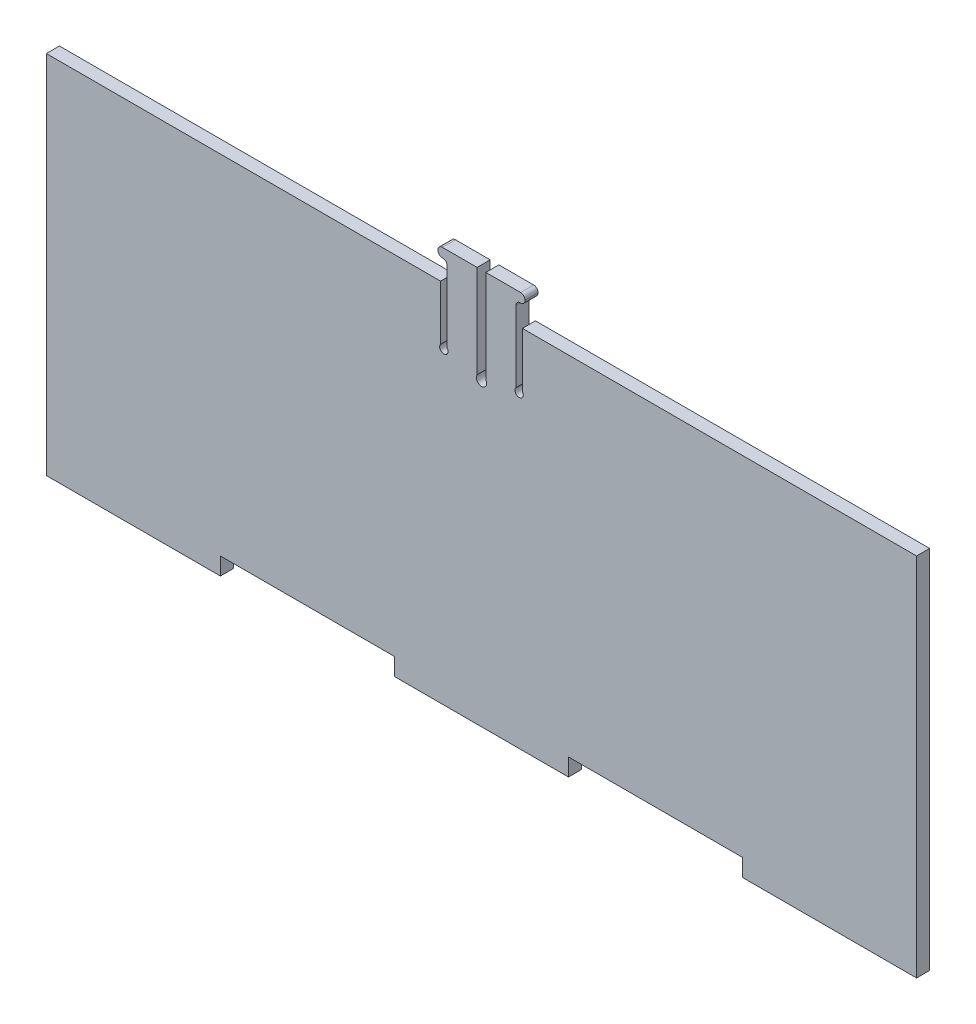
ISO-10303-21;
HEADER;
FILE_DESCRIPTION(('STEP AP214'),'2;1');
FILE_NAME('part.step','',(''),(''),'','','');
FILE_SCHEMA(('AUTOMOTIVE_DESIGN { 1 0 10303 214 1 1 1 1 }'));
ENDSEC;
DATA;
#1=APPLICATION_CONTEXT('core data for automotive mechanical design processes');
#2=APPLICATION_PROTOCOL_DEFINITION('international standard','automotive_design',2000,#1);
#3=PRODUCT_CONTEXT('',#1,'mechanical');
#4=PRODUCT('Part','Part','',(#3));
#5=PRODUCT_RELATED_PRODUCT_CATEGORY('part','',(#4));
#6=PRODUCT_DEFINITION_FORMATION('','',#4);
#7=PRODUCT_DEFINITION_CONTEXT('part definition',#1,'design');
#8=PRODUCT_DEFINITION('design','',#6,#7);
#9=PRODUCT_DEFINITION_SHAPE('','',#8);
#10=(LENGTH_UNIT() NAMED_UNIT(*) SI_UNIT(.MILLI.,.METRE.));
#11=(NAMED_UNIT(*) PLANE_ANGLE_UNIT() SI_UNIT($,.RADIAN.));
#12=(NAMED_UNIT(*) SI_UNIT($,.STERADIAN.) SOLID_ANGLE_UNIT());
#13=UNCERTAINTY_MEASURE_WITH_UNIT(LENGTH_MEASURE(1.E-05),#10,'distance_accuracy_value','');
#14=(GEOMETRIC_REPRESENTATION_CONTEXT(3) GLOBAL_UNCERTAINTY_ASSIGNED_CONTEXT((#13)) GLOBAL_UNIT_ASSIGNED_CONTEXT((#10,
#11,#12)) REPRESENTATION_CONTEXT('',''));
#15=CARTESIAN_POINT('',(0.,0.,0.));
#16=DIRECTION('',(0.,0.,1.));
#17=DIRECTION('',(1.,0.,0.));
#18=AXIS2_PLACEMENT_3D('',#15,#16,#17);
#19=CARTESIAN_POINT('',(0.,26.9392668132343,3.));
#20=DIRECTION('',(0.,0.,-1.));
#21=DIRECTION('',(-1.,0.,0.));
#22=AXIS2_PLACEMENT_3D('',#19,#20,#21);
#23=CYLINDRICAL_SURFACE('',#22,1.18948390251817);
#24=CARTESIAN_POINT('',(0.,26.9392668132343,0.));
#25=DIRECTION('',(0.,0.,1.));
#26=DIRECTION('',(1.,0.,0.));
#27=AXIS2_PLACEMENT_3D('',#24,#25,#26);
#28=CIRCLE('',#27,1.18948390251817);
#29=CARTESIAN_POINT('',(-1.00000000000001,27.5833723592047,0.));
#30=VERTEX_POINT('',#29);
#31=CARTESIAN_POINT('',(1.00000000000001,27.5833723592047,0.));
#32=VERTEX_POINT('',#31);
#33=EDGE_CURVE('E282',#30,#32,#28,.T.);
#34=ORIENTED_EDGE('',*,*,#33,.F.);
#35=DIRECTION('',(0.,0.,-1.));
#36=VECTOR('',#35,1.);
#37=CARTESIAN_POINT('',(-1.00000000000001,27.5833723592047,3.));
#38=LINE('',#37,#36);
#39=CARTESIAN_POINT('',(-1.00000000000001,27.5833723592047,3.));
#40=VERTEX_POINT('',#39);
#41=EDGE_CURVE('E11',#40,#30,#38,.T.);
#42=ORIENTED_EDGE('',*,*,#41,.F.);
#43=CARTESIAN_POINT('',(0.,26.9392668132343,3.));
#44=DIRECTION('',(0.,0.,1.));
#45=DIRECTION('',(1.,0.,0.));
#46=AXIS2_PLACEMENT_3D('',#43,#44,#45);
#47=CIRCLE('',#46,1.18948390251817);
#48=CARTESIAN_POINT('',(1.00000000000001,27.5833723592047,3.));
#49=VERTEX_POINT('',#48);
#50=EDGE_CURVE('E366',#40,#49,#47,.T.);
#51=ORIENTED_EDGE('',*,*,#50,.T.);
#52=DIRECTION('',(0.,0.,-1.));
#53=VECTOR('',#52,1.);
#54=CARTESIAN_POINT('',(1.00000000000001,27.5833723592047,3.));
#55=LINE('',#54,#53);
#56=EDGE_CURVE('E48',#49,#32,#55,.T.);
#57=ORIENTED_EDGE('',*,*,#56,.T.);
#58=EDGE_LOOP('',(#34,#42,#51,#57));
#59=FACE_BOUND('',#58,.T.);
#60=ADVANCED_FACE('F32',(#59),#23,.F.);
#61=CARTESIAN_POINT('',(-1.00000000000001,0.,3.));
#62=DIRECTION('',(-1.,0.,0.));
#63=DIRECTION('',(0.,0.,1.));
#64=AXIS2_PLACEMENT_3D('',#61,#62,#63);
#65=PLANE('',#64);
#66=DIRECTION('',(0.,1.,0.));
#67=VECTOR('',#66,1.);
#68=CARTESIAN_POINT('',(-1.00000000000001,0.,0.));
#69=LINE('',#68,#67);
#70=CARTESIAN_POINT('',(-1.00000000000001,48.9392668132343,0.));
#71=VERTEX_POINT('',#70);
#72=EDGE_CURVE('E284',#30,#71,#69,.T.);
#73=ORIENTED_EDGE('',*,*,#72,.T.);
#74=DIRECTION('',(0.,0.,-1.));
#75=VECTOR('',#74,1.);
#76=CARTESIAN_POINT('',(-1.00000000000001,48.9392668132343,3.));
#77=LINE('',#76,#75);
#78=CARTESIAN_POINT('',(-1.00000000000001,48.9392668132343,3.));
#79=VERTEX_POINT('',#78);
#80=EDGE_CURVE('E40',#79,#71,#77,.T.);
#81=ORIENTED_EDGE('',*,*,#80,.F.);
#82=DIRECTION('',(0.,1.,0.));
#83=VECTOR('',#82,1.);
#84=CARTESIAN_POINT('',(-1.00000000000001,0.,3.));
#85=LINE('',#84,#83);
#86=EDGE_CURVE('E939',#40,#79,#85,.T.);
#87=ORIENTED_EDGE('',*,*,#86,.F.);
#88=ORIENTED_EDGE('',*,*,#41,.T.);
#89=EDGE_LOOP('',(#73,#81,#87,#88));
#90=FACE_BOUND('',#89,.T.);
#91=ADVANCED_FACE('F543',(#90),#65,.F.);
#92=CARTESIAN_POINT('',(0.,48.9392668132343,3.));
#93=DIRECTION('',(0.,-1.,0.));
#94=DIRECTION('',(0.,0.,-1.));
#95=AXIS2_PLACEMENT_3D('',#92,#93,#94);
#96=PLANE('',#95);
#97=DIRECTION('',(-1.,0.,0.));
#98=VECTOR('',#97,1.);
#99=CARTESIAN_POINT('',(0.,48.9392668132343,0.));
#100=LINE('',#99,#98);
#101=CARTESIAN_POINT('',(-9.,48.9392668132343,0.));
#102=VERTEX_POINT('',#101);
#103=EDGE_CURVE('E286',#71,#102,#100,.T.);
#104=ORIENTED_EDGE('',*,*,#103,.T.);
#105=DIRECTION('',(0.,0.,-1.));
#106=VECTOR('',#105,1.);
#107=CARTESIAN_POINT('',(-9.,48.9392668132343,3.));
#108=LINE('',#107,#106);
#109=CARTESIAN_POINT('',(-9.,48.9392668132343,3.));
#110=VERTEX_POINT('',#109);
#111=EDGE_CURVE('E436',#110,#102,#108,.T.);
#112=ORIENTED_EDGE('',*,*,#111,.F.);
#113=DIRECTION('',(-1.,0.,0.));
#114=VECTOR('',#113,1.);
#115=CARTESIAN_POINT('',(0.,48.9392668132343,3.));
#116=LINE('',#115,#114);
#117=EDGE_CURVE('E445',#79,#110,#116,.T.);
#118=ORIENTED_EDGE('',*,*,#117,.F.);
#119=ORIENTED_EDGE('',*,*,#80,.T.);
#120=EDGE_LOOP('',(#104,#112,#118,#119));
#121=FACE_BOUND('',#120,.T.);
#122=ADVANCED_FACE('F443',(#121),#96,.F.);
#123=CARTESIAN_POINT('',(-9.00000000000001,47.9392668132343,3.));
#124=DIRECTION('',(0.,0.,-1.));
#125=DIRECTION('',(-1.,0.,0.));
#126=AXIS2_PLACEMENT_3D('',#123,#124,#125);
#127=CYLINDRICAL_SURFACE('',#126,1.);
#128=CARTESIAN_POINT('',(-9.00000000000001,47.9392668132343,0.));
#129=DIRECTION('',(0.,0.,1.));
#130=DIRECTION('',(1.,0.,0.));
#131=AXIS2_PLACEMENT_3D('',#128,#129,#130);
#132=CIRCLE('',#131,1.);
#133=CARTESIAN_POINT('',(-10.,47.9392668132343,0.));
#134=VERTEX_POINT('',#133);
#135=EDGE_CURVE('E288',#102,#134,#132,.T.);
#136=ORIENTED_EDGE('',*,*,#135,.T.);
#137=DIRECTION('',(0.,0.,-1.));
#138=VECTOR('',#137,1.);
#139=CARTESIAN_POINT('',(-10.,47.9392668132343,3.));
#140=LINE('',#139,#138);
#141=CARTESIAN_POINT('',(-10.,47.9392668132343,3.));
#142=VERTEX_POINT('',#141);
#143=EDGE_CURVE('E433',#142,#134,#140,.T.);
#144=ORIENTED_EDGE('',*,*,#143,.F.);
#145=CARTESIAN_POINT('',(-9.00000000000001,47.9392668132343,3.));
#146=DIRECTION('',(0.,0.,1.));
#147=DIRECTION('',(1.,0.,0.));
#148=AXIS2_PLACEMENT_3D('',#145,#146,#147);
#149=CIRCLE('',#148,1.);
#150=EDGE_CURVE('E464',#110,#142,#149,.T.);
#151=ORIENTED_EDGE('',*,*,#150,.F.);
#152=ORIENTED_EDGE('',*,*,#111,.T.);
#153=EDGE_LOOP('',(#136,#144,#151,#152));
#154=FACE_BOUND('',#153,.T.);
#155=ADVANCED_FACE('F455',(#154),#127,.T.);
#156=CARTESIAN_POINT('',(-10.,0.,3.));
#157=DIRECTION('',(1.,0.,0.));
#158=DIRECTION('',(0.,0.,-1.));
#159=AXIS2_PLACEMENT_3D('',#156,#157,#158);
#160=PLANE('',#159);
#161=DIRECTION('',(0.,-1.,0.));
#162=VECTOR('',#161,1.);
#163=CARTESIAN_POINT('',(-10.,0.,0.));
#164=LINE('',#163,#162);
#165=CARTESIAN_POINT('',(-10.,47.8392668132343,0.));
#166=VERTEX_POINT('',#165);
#167=EDGE_CURVE('E290',#134,#166,#164,.T.);
#168=ORIENTED_EDGE('',*,*,#167,.T.);
#169=DIRECTION('',(0.,0.,-1.));
#170=VECTOR('',#169,1.);
#171=CARTESIAN_POINT('',(-10.,47.8392668132343,3.));
#172=LINE('',#171,#170);
#173=CARTESIAN_POINT('',(-10.,47.8392668132343,3.));
#174=VERTEX_POINT('',#173);
#175=EDGE_CURVE('E430',#174,#166,#172,.T.);
#176=ORIENTED_EDGE('',*,*,#175,.F.);
#177=DIRECTION('',(0.,-1.,0.));
#178=VECTOR('',#177,1.);
#179=CARTESIAN_POINT('',(-10.,0.,3.));
#180=LINE('',#179,#178);
#181=EDGE_CURVE('E461',#142,#174,#180,.T.);
#182=ORIENTED_EDGE('',*,*,#181,.F.);
#183=ORIENTED_EDGE('',*,*,#143,.T.);
#184=EDGE_LOOP('',(#168,#176,#182,#183));
#185=FACE_BOUND('',#184,.T.);
#186=ADVANCED_FACE('F459',(#185),#160,.F.);
#187=CARTESIAN_POINT('',(-9.00000000000001,47.8392668132343,3.));
#188=DIRECTION('',(0.,0.,-1.));
#189=DIRECTION('',(-1.,0.,0.));
#190=AXIS2_PLACEMENT_3D('',#187,#188,#189);
#191=CYLINDRICAL_SURFACE('',#190,1.);
#192=CARTESIAN_POINT('',(-9.00000000000001,47.8392668132343,0.));
#193=DIRECTION('',(0.,0.,1.));
#194=DIRECTION('',(1.,0.,0.));
#195=AXIS2_PLACEMENT_3D('',#192,#193,#194);
#196=CIRCLE('',#195,1.);
#197=CARTESIAN_POINT('',(-9.,46.8392668132343,0.));
#198=VERTEX_POINT('',#197);
#199=EDGE_CURVE('E292',#166,#198,#196,.T.);
#200=ORIENTED_EDGE('',*,*,#199,.T.);
#201=DIRECTION('',(0.,0.,-1.));
#202=VECTOR('',#201,1.);
#203=CARTESIAN_POINT('',(-9.,46.8392668132343,3.));
#204=LINE('',#203,#202);
#205=CARTESIAN_POINT('',(-9.,46.8392668132343,3.));
#206=VERTEX_POINT('',#205);
#207=EDGE_CURVE('E427',#206,#198,#204,.T.);
#208=ORIENTED_EDGE('',*,*,#207,.F.);
#209=CARTESIAN_POINT('',(-9.00000000000001,47.8392668132343,3.));
#210=DIRECTION('',(0.,0.,1.));
#211=DIRECTION('',(1.,0.,0.));
#212=AXIS2_PLACEMENT_3D('',#209,#210,#211);
#213=CIRCLE('',#212,1.);
#214=EDGE_CURVE('E463',#174,#206,#213,.T.);
#215=ORIENTED_EDGE('',*,*,#214,.F.);
#216=ORIENTED_EDGE('',*,*,#175,.T.);
#217=EDGE_LOOP('',(#200,#208,#215,#216));
#218=FACE_BOUND('',#217,.T.);
#219=ADVANCED_FACE('F556',(#218),#191,.T.);
#220=CARTESIAN_POINT('',(0.,46.8392668132343,3.));
#221=DIRECTION('',(0.,1.,0.));
#222=DIRECTION('',(0.,0.,1.));
#223=AXIS2_PLACEMENT_3D('',#220,#221,#222);
#224=PLANE('',#223);
#225=DIRECTION('',(1.,0.,0.));
#226=VECTOR('',#225,1.);
#227=CARTESIAN_POINT('',(0.,46.8392668132343,0.));
#228=LINE('',#227,#226);
#229=CARTESIAN_POINT('',(-8.89999999999999,46.8392668132343,0.));
#230=VERTEX_POINT('',#229);
#231=EDGE_CURVE('E294',#198,#230,#228,.T.);
#232=ORIENTED_EDGE('',*,*,#231,.T.);
#233=DIRECTION('',(0.,0.,-1.));
#234=VECTOR('',#233,1.);
#235=CARTESIAN_POINT('',(-8.89999999999999,46.8392668132343,3.));
#236=LINE('',#235,#234);
#237=CARTESIAN_POINT('',(-8.89999999999999,46.8392668132343,3.));
#238=VERTEX_POINT('',#237);
#239=EDGE_CURVE('E424',#238,#230,#236,.T.);
#240=ORIENTED_EDGE('',*,*,#239,.F.);
#241=DIRECTION('',(1.,0.,0.));
#242=VECTOR('',#241,1.);
#243=CARTESIAN_POINT('',(0.,46.8392668132343,3.));
#244=LINE('',#243,#242);
#245=EDGE_CURVE('E466',#206,#238,#244,.T.);
#246=ORIENTED_EDGE('',*,*,#245,.F.);
#247=ORIENTED_EDGE('',*,*,#207,.T.);
#248=EDGE_LOOP('',(#232,#240,#246,#247));
#249=FACE_BOUND('',#248,.T.);
#250=ADVANCED_FACE('F559',(#249),#224,.F.);
#251=CARTESIAN_POINT('',(-8.89999999999998,45.8392668132343,3.));
#252=DIRECTION('',(0.,0.,-1.));
#253=DIRECTION('',(-1.,0.,0.));
#254=AXIS2_PLACEMENT_3D('',#251,#252,#253);
#255=CYLINDRICAL_SURFACE('',#254,1.);
#256=CARTESIAN_POINT('',(-8.89999999999998,45.8392668132343,0.));
#257=DIRECTION('',(0.,0.,1.));
#258=DIRECTION('',(1.,0.,0.));
#259=AXIS2_PLACEMENT_3D('',#256,#257,#258);
#260=CIRCLE('',#259,1.);
#261=CARTESIAN_POINT('',(-7.89999999999998,45.8392668132343,0.));
#262=VERTEX_POINT('',#261);
#263=EDGE_CURVE('E296',#230,#262,#260,.F.);
#264=ORIENTED_EDGE('',*,*,#263,.T.);
#265=DIRECTION('',(0.,0.,-1.));
#266=VECTOR('',#265,1.);
#267=CARTESIAN_POINT('',(-7.89999999999998,45.8392668132343,3.));
#268=LINE('',#267,#266);
#269=CARTESIAN_POINT('',(-7.89999999999998,45.8392668132343,3.));
#270=VERTEX_POINT('',#269);
#271=EDGE_CURVE('E421',#270,#262,#268,.T.);
#272=ORIENTED_EDGE('',*,*,#271,.F.);
#273=CARTESIAN_POINT('',(-8.89999999999998,45.8392668132343,3.));
#274=DIRECTION('',(0.,0.,1.));
#275=DIRECTION('',(1.,0.,0.));
#276=AXIS2_PLACEMENT_3D('',#273,#274,#275);
#277=CIRCLE('',#276,1.);
#278=EDGE_CURVE('E472',#238,#270,#277,.F.);
#279=ORIENTED_EDGE('',*,*,#278,.F.);
#280=ORIENTED_EDGE('',*,*,#239,.T.);
#281=EDGE_LOOP('',(#264,#272,#279,#280));
#282=FACE_BOUND('',#281,.T.);
#283=ADVANCED_FACE('F563',(#282),#255,.F.);
#284=CARTESIAN_POINT('',(-7.89999999999998,0.,3.));
#285=DIRECTION('',(1.,0.,0.));
#286=DIRECTION('',(0.,0.,-1.));
#287=AXIS2_PLACEMENT_3D('',#284,#285,#286);
#288=PLANE('',#287);
#289=DIRECTION('',(0.,-1.,0.));
#290=VECTOR('',#289,1.);
#291=CARTESIAN_POINT('',(-7.89999999999998,0.,0.));
#292=LINE('',#291,#290);
#293=CARTESIAN_POINT('',(-7.89999999999998,29.4379553961168,0.));
#294=VERTEX_POINT('',#293);
#295=EDGE_CURVE('E298',#262,#294,#292,.T.);
#296=ORIENTED_EDGE('',*,*,#295,.T.);
#297=DIRECTION('',(0.,0.,-1.));
#298=VECTOR('',#297,1.);
#299=CARTESIAN_POINT('',(-7.89999999999998,29.4379553961168,3.));
#300=LINE('',#299,#298);
#301=CARTESIAN_POINT('',(-7.89999999999998,29.4379553961168,3.));
#302=VERTEX_POINT('',#301);
#303=EDGE_CURVE('E418',#302,#294,#300,.T.);
#304=ORIENTED_EDGE('',*,*,#303,.F.);
#305=DIRECTION('',(0.,-1.,0.));
#306=VECTOR('',#305,1.);
#307=CARTESIAN_POINT('',(-7.89999999999998,0.,3.));
#308=LINE('',#307,#306);
#309=EDGE_CURVE('E474',#270,#302,#308,.T.);
#310=ORIENTED_EDGE('',*,*,#309,.F.);
#311=ORIENTED_EDGE('',*,*,#271,.T.);
#312=EDGE_LOOP('',(#296,#304,#310,#311));
#313=FACE_BOUND('',#312,.T.);
#314=ADVANCED_FACE('F567',(#313),#288,.F.);
#315=CARTESIAN_POINT('',(-8.64999999999998,28.8392668132343,3.));
#316=DIRECTION('',(0.,0.,-1.));
#317=DIRECTION('',(-1.,0.,0.));
#318=AXIS2_PLACEMENT_3D('',#315,#316,#317);
#319=CYLINDRICAL_SURFACE('',#318,0.959649946216797);
#320=CARTESIAN_POINT('',(-8.64999999999998,28.8392668132343,0.));
#321=DIRECTION('',(0.,0.,1.));
#322=DIRECTION('',(1.,0.,0.));
#323=AXIS2_PLACEMENT_3D('',#320,#321,#322);
#324=CIRCLE('',#323,0.959649946216797);
#325=CARTESIAN_POINT('',(-9.39999999999999,29.4379553961168,0.));
#326=VERTEX_POINT('',#325);
#327=EDGE_CURVE('E300',#294,#326,#324,.F.);
#328=ORIENTED_EDGE('',*,*,#327,.T.);
#329=DIRECTION('',(0.,0.,-1.));
#330=VECTOR('',#329,1.);
#331=CARTESIAN_POINT('',(-9.39999999999999,29.4379553961168,3.));
#332=LINE('',#331,#330);
#333=CARTESIAN_POINT('',(-9.39999999999999,29.4379553961168,3.));
#334=VERTEX_POINT('',#333);
#335=EDGE_CURVE('E415',#334,#326,#332,.T.);
#336=ORIENTED_EDGE('',*,*,#335,.F.);
#337=CARTESIAN_POINT('',(-8.64999999999998,28.8392668132343,3.));
#338=DIRECTION('',(0.,0.,1.));
#339=DIRECTION('',(1.,0.,0.));
#340=AXIS2_PLACEMENT_3D('',#337,#338,#339);
#341=CIRCLE('',#340,0.959649946216797);
#342=EDGE_CURVE('E476',#302,#334,#341,.F.);
#343=ORIENTED_EDGE('',*,*,#342,.F.);
#344=ORIENTED_EDGE('',*,*,#303,.T.);
#345=EDGE_LOOP('',(#328,#336,#343,#344));
#346=FACE_BOUND('',#345,.T.);
#347=ADVANCED_FACE('F571',(#346),#319,.F.);
#348=CARTESIAN_POINT('',(-9.39999999999999,0.,3.));
#349=DIRECTION('',(-1.,0.,0.));
#350=DIRECTION('',(0.,0.,1.));
#351=AXIS2_PLACEMENT_3D('',#348,#349,#350);
#352=PLANE('',#351);
#353=DIRECTION('',(0.,1.,0.));
#354=VECTOR('',#353,1.);
#355=CARTESIAN_POINT('',(-9.39999999999999,0.,0.));
#356=LINE('',#355,#354);
#357=CARTESIAN_POINT('',(-9.39999999999999,42.,0.));
#358=VERTEX_POINT('',#357);
#359=EDGE_CURVE('E302',#326,#358,#356,.T.);
#360=ORIENTED_EDGE('',*,*,#359,.T.);
#361=DIRECTION('',(0.,0.,-1.));
#362=VECTOR('',#361,1.);
#363=CARTESIAN_POINT('',(-9.39999999999999,42.,3.));
#364=LINE('',#363,#362);
#365=CARTESIAN_POINT('',(-9.39999999999999,42.,3.));
#366=VERTEX_POINT('',#365);
#367=EDGE_CURVE('E412',#366,#358,#364,.T.);
#368=ORIENTED_EDGE('',*,*,#367,.F.);
#369=DIRECTION('',(0.,1.,0.));
#370=VECTOR('',#369,1.);
#371=CARTESIAN_POINT('',(-9.39999999999999,0.,3.));
#372=LINE('',#371,#370);
#373=EDGE_CURVE('E478',#334,#366,#372,.T.);
#374=ORIENTED_EDGE('',*,*,#373,.F.);
#375=ORIENTED_EDGE('',*,*,#335,.T.);
#376=EDGE_LOOP('',(#360,#368,#374,#375));
#377=FACE_BOUND('',#376,.T.);
#378=ADVANCED_FACE('F575',(#377),#352,.F.);
#379=CARTESIAN_POINT('',(0.,42.,3.));
#380=DIRECTION('',(0.,-1.,0.));
#381=DIRECTION('',(1.,0.,0.));
#382=AXIS2_PLACEMENT_3D('',#379,#380,#381);
#383=PLANE('',#382);
#384=DIRECTION('',(-1.,0.,0.));
#385=VECTOR('',#384,1.);
#386=CARTESIAN_POINT('',(0.,42.,0.));
#387=LINE('',#386,#385);
#388=CARTESIAN_POINT('',(-100.,42.,0.));
#389=VERTEX_POINT('',#388);
#390=EDGE_CURVE('E304',#358,#389,#387,.T.);
#391=ORIENTED_EDGE('',*,*,#390,.T.);
#392=DIRECTION('',(0.,0.,-1.));
#393=VECTOR('',#392,1.);
#394=CARTESIAN_POINT('',(-100.,42.,3.));
#395=LINE('',#394,#393);
#396=CARTESIAN_POINT('',(-100.,42.,3.));
#397=VERTEX_POINT('',#396);
#398=EDGE_CURVE('E410',#397,#389,#395,.T.);
#399=ORIENTED_EDGE('',*,*,#398,.F.);
#400=DIRECTION('',(-1.,0.,0.));
#401=VECTOR('',#400,1.);
#402=CARTESIAN_POINT('',(0.,42.,3.));
#403=LINE('',#402,#401);
#404=EDGE_CURVE('E480',#366,#397,#403,.T.);
#405=ORIENTED_EDGE('',*,*,#404,.F.);
#406=ORIENTED_EDGE('',*,*,#367,.T.);
#407=EDGE_LOOP('',(#391,#399,#405,#406));
#408=FACE_BOUND('',#407,.T.);
#409=ADVANCED_FACE('F579',(#408),#383,.F.);
#410=CARTESIAN_POINT('',(-100.,0.,3.));
#411=DIRECTION('',(-1.,0.,0.));
#412=DIRECTION('',(0.,0.,1.));
#413=AXIS2_PLACEMENT_3D('',#410,#411,#412);
#414=PLANE('',#413);
#415=DIRECTION('',(0.,1.,0.));
#416=VECTOR('',#415,1.);
#417=CARTESIAN_POINT('',(-100.,0.,0.));
#418=LINE('',#417,#416);
#419=CARTESIAN_POINT('',(-100.,-42.,0.));
#420=VERTEX_POINT('',#419);
#421=EDGE_CURVE('E307',#420,#389,#418,.T.);
#422=ORIENTED_EDGE('',*,*,#421,.F.);
#423=DIRECTION('',(0.,0.,-1.));
#424=VECTOR('',#423,1.);
#425=CARTESIAN_POINT('',(-100.,-42.,3.));
#426=LINE('',#425,#424);
#427=CARTESIAN_POINT('',(-100.,-42.,3.));
#428=VERTEX_POINT('',#427);
#429=EDGE_CURVE('E408',#428,#420,#426,.T.);
#430=ORIENTED_EDGE('',*,*,#429,.F.);
#431=DIRECTION('',(0.,1.,0.));
#432=VECTOR('',#431,1.);
#433=CARTESIAN_POINT('',(-100.,0.,3.));
#434=LINE('',#433,#432);
#435=EDGE_CURVE('E482',#428,#397,#434,.T.);
#436=ORIENTED_EDGE('',*,*,#435,.T.);
#437=ORIENTED_EDGE('',*,*,#398,.T.);
#438=EDGE_LOOP('',(#422,#430,#436,#437));
#439=FACE_BOUND('',#438,.T.);
#440=ADVANCED_FACE('F583',(#439),#414,.T.);
#441=CARTESIAN_POINT('',(0.,-42.,3.));
#442=DIRECTION('',(0.,1.,0.));
#443=DIRECTION('',(0.,0.,1.));
#444=AXIS2_PLACEMENT_3D('',#441,#442,#443);
#445=PLANE('',#444);
#446=DIRECTION('',(1.,0.,0.));
#447=VECTOR('',#446,1.);
#448=CARTESIAN_POINT('',(0.,-42.,0.));
#449=LINE('',#448,#447);
#450=CARTESIAN_POINT('',(-60.,-42.,0.));
#451=VERTEX_POINT('',#450);
#452=EDGE_CURVE('E310',#420,#451,#449,.T.);
#453=ORIENTED_EDGE('',*,*,#452,.T.);
#454=DIRECTION('',(0.,0.,-1.));
#455=VECTOR('',#454,1.);
#456=CARTESIAN_POINT('',(-60.,-42.,3.));
#457=LINE('',#456,#455);
#458=CARTESIAN_POINT('',(-60.,-42.,3.));
#459=VERTEX_POINT('',#458);
#460=EDGE_CURVE('E405',#459,#451,#457,.T.);
#461=ORIENTED_EDGE('',*,*,#460,.F.);
#462=DIRECTION('',(1.,0.,0.));
#463=VECTOR('',#462,1.);
#464=CARTESIAN_POINT('',(0.,-42.,3.));
#465=LINE('',#464,#463);
#466=EDGE_CURVE('E485',#428,#459,#465,.T.);
#467=ORIENTED_EDGE('',*,*,#466,.F.);
#468=ORIENTED_EDGE('',*,*,#429,.T.);
#469=EDGE_LOOP('',(#453,#461,#467,#468));
#470=FACE_BOUND('',#469,.T.);
#471=ADVANCED_FACE('F587',(#470),#445,.F.);
#472=CARTESIAN_POINT('',(-60.,0.,3.));
#473=DIRECTION('',(-1.,0.,0.));
#474=DIRECTION('',(0.,0.,1.));
#475=AXIS2_PLACEMENT_3D('',#472,#473,#474);
#476=PLANE('',#475);
#477=DIRECTION('',(0.,1.,0.));
#478=VECTOR('',#477,1.);
#479=CARTESIAN_POINT('',(-60.,0.,0.));
#480=LINE('',#479,#478);
#481=CARTESIAN_POINT('',(-60.,-38.,0.));
#482=VERTEX_POINT('',#481);
#483=EDGE_CURVE('E312',#451,#482,#480,.T.);
#484=ORIENTED_EDGE('',*,*,#483,.T.);
#485=DIRECTION('',(0.,0.,-1.));
#486=VECTOR('',#485,1.);
#487=CARTESIAN_POINT('',(-60.,-38.,3.));
#488=LINE('',#487,#486);
#489=CARTESIAN_POINT('',(-60.,-38.,3.));
#490=VERTEX_POINT('',#489);
#491=EDGE_CURVE('E402',#490,#482,#488,.T.);
#492=ORIENTED_EDGE('',*,*,#491,.F.);
#493=DIRECTION('',(0.,1.,0.));
#494=VECTOR('',#493,1.);
#495=CARTESIAN_POINT('',(-60.,0.,3.));
#496=LINE('',#495,#494);
#497=EDGE_CURVE('E487',#459,#490,#496,.T.);
#498=ORIENTED_EDGE('',*,*,#497,.F.);
#499=ORIENTED_EDGE('',*,*,#460,.T.);
#500=EDGE_LOOP('',(#484,#492,#498,#499));
#501=FACE_BOUND('',#500,.T.);
#502=ADVANCED_FACE('F591',(#501),#476,.F.);
#503=CARTESIAN_POINT('',(0.,-38.,3.));
#504=DIRECTION('',(0.,1.,0.));
#505=DIRECTION('',(0.,0.,1.));
#506=AXIS2_PLACEMENT_3D('',#503,#504,#505);
#507=PLANE('',#506);
#508=DIRECTION('',(1.,0.,0.));
#509=VECTOR('',#508,1.);
#510=CARTESIAN_POINT('',(0.,-38.,0.));
#511=LINE('',#510,#509);
#512=CARTESIAN_POINT('',(-20.,-38.,0.));
#513=VERTEX_POINT('',#512);
#514=EDGE_CURVE('E314',#482,#513,#511,.T.);
#515=ORIENTED_EDGE('',*,*,#514,.T.);
#516=DIRECTION('',(0.,0.,-1.));
#517=VECTOR('',#516,1.);
#518=CARTESIAN_POINT('',(-20.,-38.,3.));
#519=LINE('',#518,#517);
#520=CARTESIAN_POINT('',(-20.,-38.,3.));
#521=VERTEX_POINT('',#520);
#522=EDGE_CURVE('E400',#521,#513,#519,.T.);
#523=ORIENTED_EDGE('',*,*,#522,.F.);
#524=DIRECTION('',(1.,0.,0.));
#525=VECTOR('',#524,1.);
#526=CARTESIAN_POINT('',(0.,-38.,3.));
#527=LINE('',#526,#525);
#528=EDGE_CURVE('E489',#490,#521,#527,.T.);
#529=ORIENTED_EDGE('',*,*,#528,.F.);
#530=ORIENTED_EDGE('',*,*,#491,.T.);
#531=EDGE_LOOP('',(#515,#523,#529,#530));
#532=FACE_BOUND('',#531,.T.);
#533=ADVANCED_FACE('F595',(#532),#507,.F.);
#534=CARTESIAN_POINT('',(-20.,0.,3.));
#535=DIRECTION('',(-1.,0.,0.));
#536=DIRECTION('',(0.,0.,1.));
#537=AXIS2_PLACEMENT_3D('',#534,#535,#536);
#538=PLANE('',#537);
#539=DIRECTION('',(0.,1.,0.));
#540=VECTOR('',#539,1.);
#541=CARTESIAN_POINT('',(-20.,0.,0.));
#542=LINE('',#541,#540);
#543=CARTESIAN_POINT('',(-20.,-42.,0.));
#544=VERTEX_POINT('',#543);
#545=EDGE_CURVE('E317',#544,#513,#542,.T.);
#546=ORIENTED_EDGE('',*,*,#545,.F.);
#547=DIRECTION('',(0.,0.,-1.));
#548=VECTOR('',#547,1.);
#549=CARTESIAN_POINT('',(-20.,-42.,3.));
#550=LINE('',#549,#548);
#551=CARTESIAN_POINT('',(-20.,-42.,3.));
#552=VERTEX_POINT('',#551);
#553=EDGE_CURVE('E398',#552,#544,#550,.T.);
#554=ORIENTED_EDGE('',*,*,#553,.F.);
#555=DIRECTION('',(0.,1.,0.));
#556=VECTOR('',#555,1.);
#557=CARTESIAN_POINT('',(-20.,0.,3.));
#558=LINE('',#557,#556);
#559=EDGE_CURVE('E491',#552,#521,#558,.T.);
#560=ORIENTED_EDGE('',*,*,#559,.T.);
#561=ORIENTED_EDGE('',*,*,#522,.T.);
#562=EDGE_LOOP('',(#546,#554,#560,#561));
#563=FACE_BOUND('',#562,.T.);
#564=ADVANCED_FACE('F599',(#563),#538,.T.);
#565=CARTESIAN_POINT('',(0.,-42.,3.));
#566=DIRECTION('',(0.,-1.,0.));
#567=DIRECTION('',(0.,0.,-1.));
#568=AXIS2_PLACEMENT_3D('',#565,#566,#567);
#569=PLANE('',#568);
#570=DIRECTION('',(-1.,0.,0.));
#571=VECTOR('',#570,1.);
#572=CARTESIAN_POINT('',(0.,-42.,0.));
#573=LINE('',#572,#571);
#574=CARTESIAN_POINT('',(20.,-42.,0.));
#575=VERTEX_POINT('',#574);
#576=EDGE_CURVE('E320',#575,#544,#573,.T.);
#577=ORIENTED_EDGE('',*,*,#576,.F.);
#578=DIRECTION('',(0.,0.,-1.));
#579=VECTOR('',#578,1.);
#580=CARTESIAN_POINT('',(20.,-42.,3.));
#581=LINE('',#580,#579);
#582=CARTESIAN_POINT('',(20.,-42.,3.));
#583=VERTEX_POINT('',#582);
#584=EDGE_CURVE('E396',#583,#575,#581,.T.);
#585=ORIENTED_EDGE('',*,*,#584,.F.);
#586=DIRECTION('',(-1.,0.,0.));
#587=VECTOR('',#586,1.);
#588=CARTESIAN_POINT('',(0.,-42.,3.));
#589=LINE('',#588,#587);
#590=EDGE_CURVE('E494',#583,#552,#589,.T.);
#591=ORIENTED_EDGE('',*,*,#590,.T.);
#592=ORIENTED_EDGE('',*,*,#553,.T.);
#593=EDGE_LOOP('',(#577,#585,#591,#592));
#594=FACE_BOUND('',#593,.T.);
#595=ADVANCED_FACE('F603',(#594),#569,.T.);
#596=CARTESIAN_POINT('',(20.,0.,3.));
#597=DIRECTION('',(-1.,0.,0.));
#598=DIRECTION('',(0.,0.,1.));
#599=AXIS2_PLACEMENT_3D('',#596,#597,#598);
#600=PLANE('',#599);
#601=DIRECTION('',(0.,1.,0.));
#602=VECTOR('',#601,1.);
#603=CARTESIAN_POINT('',(20.,0.,0.));
#604=LINE('',#603,#602);
#605=CARTESIAN_POINT('',(20.,-38.,0.));
#606=VERTEX_POINT('',#605);
#607=EDGE_CURVE('E323',#575,#606,#604,.T.);
#608=ORIENTED_EDGE('',*,*,#607,.T.);
#609=DIRECTION('',(0.,0.,-1.));
#610=VECTOR('',#609,1.);
#611=CARTESIAN_POINT('',(20.,-38.,3.));
#612=LINE('',#611,#610);
#613=CARTESIAN_POINT('',(20.,-38.,3.));
#614=VERTEX_POINT('',#613);
#615=EDGE_CURVE('E393',#614,#606,#612,.T.);
#616=ORIENTED_EDGE('',*,*,#615,.F.);
#617=DIRECTION('',(0.,1.,0.));
#618=VECTOR('',#617,1.);
#619=CARTESIAN_POINT('',(20.,0.,3.));
#620=LINE('',#619,#618);
#621=EDGE_CURVE('E497',#583,#614,#620,.T.);
#622=ORIENTED_EDGE('',*,*,#621,.F.);
#623=ORIENTED_EDGE('',*,*,#584,.T.);
#624=EDGE_LOOP('',(#608,#616,#622,#623));
#625=FACE_BOUND('',#624,.T.);
#626=ADVANCED_FACE('F607',(#625),#600,.F.);
#627=CARTESIAN_POINT('',(0.,-38.,3.));
#628=DIRECTION('',(0.,1.,0.));
#629=DIRECTION('',(0.,0.,1.));
#630=AXIS2_PLACEMENT_3D('',#627,#628,#629);
#631=PLANE('',#630);
#632=DIRECTION('',(1.,0.,0.));
#633=VECTOR('',#632,1.);
#634=CARTESIAN_POINT('',(0.,-38.,0.));
#635=LINE('',#634,#633);
#636=CARTESIAN_POINT('',(60.,-38.,0.));
#637=VERTEX_POINT('',#636);
#638=EDGE_CURVE('E325',#606,#637,#635,.T.);
#639=ORIENTED_EDGE('',*,*,#638,.T.);
#640=DIRECTION('',(0.,0.,-1.));
#641=VECTOR('',#640,1.);
#642=CARTESIAN_POINT('',(60.,-38.,3.));
#643=LINE('',#642,#641);
#644=CARTESIAN_POINT('',(60.,-38.,3.));
#645=VERTEX_POINT('',#644);
#646=EDGE_CURVE('E391',#645,#637,#643,.T.);
#647=ORIENTED_EDGE('',*,*,#646,.F.);
#648=DIRECTION('',(1.,0.,0.));
#649=VECTOR('',#648,1.);
#650=CARTESIAN_POINT('',(0.,-38.,3.));
#651=LINE('',#650,#649);
#652=EDGE_CURVE('E499',#614,#645,#651,.T.);
#653=ORIENTED_EDGE('',*,*,#652,.F.);
#654=ORIENTED_EDGE('',*,*,#615,.T.);
#655=EDGE_LOOP('',(#639,#647,#653,#654));
#656=FACE_BOUND('',#655,.T.);
#657=ADVANCED_FACE('F611',(#656),#631,.F.);
#658=CARTESIAN_POINT('',(60.,0.,3.));
#659=DIRECTION('',(-1.,0.,0.));
#660=DIRECTION('',(0.,0.,1.));
#661=AXIS2_PLACEMENT_3D('',#658,#659,#660);
#662=PLANE('',#661);
#663=DIRECTION('',(0.,1.,0.));
#664=VECTOR('',#663,1.);
#665=CARTESIAN_POINT('',(60.,0.,0.));
#666=LINE('',#665,#664);
#667=CARTESIAN_POINT('',(60.,-42.,0.));
#668=VERTEX_POINT('',#667);
#669=EDGE_CURVE('E328',#668,#637,#666,.T.);
#670=ORIENTED_EDGE('',*,*,#669,.F.);
#671=DIRECTION('',(0.,0.,-1.));
#672=VECTOR('',#671,1.);
#673=CARTESIAN_POINT('',(60.,-42.,3.));
#674=LINE('',#673,#672);
#675=CARTESIAN_POINT('',(60.,-42.,3.));
#676=VERTEX_POINT('',#675);
#677=EDGE_CURVE('E389',#676,#668,#674,.T.);
#678=ORIENTED_EDGE('',*,*,#677,.F.);
#679=DIRECTION('',(0.,1.,0.));
#680=VECTOR('',#679,1.);
#681=CARTESIAN_POINT('',(60.,0.,3.));
#682=LINE('',#681,#680);
#683=EDGE_CURVE('E501',#676,#645,#682,.T.);
#684=ORIENTED_EDGE('',*,*,#683,.T.);
#685=ORIENTED_EDGE('',*,*,#646,.T.);
#686=EDGE_LOOP('',(#670,#678,#684,#685));
#687=FACE_BOUND('',#686,.T.);
#688=ADVANCED_FACE('F615',(#687),#662,.T.);
#689=CARTESIAN_POINT('',(0.,-42.,3.));
#690=DIRECTION('',(0.,-1.,0.));
#691=DIRECTION('',(1.,0.,0.));
#692=AXIS2_PLACEMENT_3D('',#689,#690,#691);
#693=PLANE('',#692);
#694=DIRECTION('',(-1.,0.,0.));
#695=VECTOR('',#694,1.);
#696=CARTESIAN_POINT('',(0.,-42.,0.));
#697=LINE('',#696,#695);
#698=CARTESIAN_POINT('',(100.,-42.,0.));
#699=VERTEX_POINT('',#698);
#700=EDGE_CURVE('E331',#699,#668,#697,.T.);
#701=ORIENTED_EDGE('',*,*,#700,.F.);
#702=DIRECTION('',(0.,0.,-1.));
#703=VECTOR('',#702,1.);
#704=CARTESIAN_POINT('',(100.,-42.,3.));
#705=LINE('',#704,#703);
#706=CARTESIAN_POINT('',(100.,-42.,3.));
#707=VERTEX_POINT('',#706);
#708=EDGE_CURVE('E387',#707,#699,#705,.T.);
#709=ORIENTED_EDGE('',*,*,#708,.F.);
#710=DIRECTION('',(-1.,0.,0.));
#711=VECTOR('',#710,1.);
#712=CARTESIAN_POINT('',(0.,-42.,3.));
#713=LINE('',#712,#711);
#714=EDGE_CURVE('E504',#707,#676,#713,.T.);
#715=ORIENTED_EDGE('',*,*,#714,.T.);
#716=ORIENTED_EDGE('',*,*,#677,.T.);
#717=EDGE_LOOP('',(#701,#709,#715,#716));
#718=FACE_BOUND('',#717,.T.);
#719=ADVANCED_FACE('F619',(#718),#693,.T.);
#720=CARTESIAN_POINT('',(100.,0.,3.));
#721=DIRECTION('',(-1.,0.,0.));
#722=DIRECTION('',(0.,0.,1.));
#723=AXIS2_PLACEMENT_3D('',#720,#721,#722);
#724=PLANE('',#723);
#725=DIRECTION('',(0.,1.,0.));
#726=VECTOR('',#725,1.);
#727=CARTESIAN_POINT('',(100.,0.,0.));
#728=LINE('',#727,#726);
#729=CARTESIAN_POINT('',(100.,42.,0.));
#730=VERTEX_POINT('',#729);
#731=EDGE_CURVE('E334',#699,#730,#728,.T.);
#732=ORIENTED_EDGE('',*,*,#731,.T.);
#733=DIRECTION('',(0.,0.,-1.));
#734=VECTOR('',#733,1.);
#735=CARTESIAN_POINT('',(100.,42.,3.));
#736=LINE('',#735,#734);
#737=CARTESIAN_POINT('',(100.,42.,3.));
#738=VERTEX_POINT('',#737);
#739=EDGE_CURVE('E384',#738,#730,#736,.T.);
#740=ORIENTED_EDGE('',*,*,#739,.F.);
#741=DIRECTION('',(0.,1.,0.));
#742=VECTOR('',#741,1.);
#743=CARTESIAN_POINT('',(100.,0.,3.));
#744=LINE('',#743,#742);
#745=EDGE_CURVE('E507',#707,#738,#744,.T.);
#746=ORIENTED_EDGE('',*,*,#745,.F.);
#747=ORIENTED_EDGE('',*,*,#708,.T.);
#748=EDGE_LOOP('',(#732,#740,#746,#747));
#749=FACE_BOUND('',#748,.T.);
#750=ADVANCED_FACE('F623',(#749),#724,.F.);
#751=CARTESIAN_POINT('',(0.,42.,3.));
#752=DIRECTION('',(0.,-1.,0.));
#753=DIRECTION('',(1.,0.,0.));
#754=AXIS2_PLACEMENT_3D('',#751,#752,#753);
#755=PLANE('',#754);
#756=DIRECTION('',(-1.,0.,0.));
#757=VECTOR('',#756,1.);
#758=CARTESIAN_POINT('',(0.,42.,0.));
#759=LINE('',#758,#757);
#760=CARTESIAN_POINT('',(9.39999999999999,42.,0.));
#761=VERTEX_POINT('',#760);
#762=EDGE_CURVE('E336',#730,#761,#759,.T.);
#763=ORIENTED_EDGE('',*,*,#762,.T.);
#764=DIRECTION('',(0.,0.,-1.));
#765=VECTOR('',#764,1.);
#766=CARTESIAN_POINT('',(9.39999999999999,42.,3.));
#767=LINE('',#766,#765);
#768=CARTESIAN_POINT('',(9.39999999999999,42.,3.));
#769=VERTEX_POINT('',#768);
#770=EDGE_CURVE('E382',#769,#761,#767,.T.);
#771=ORIENTED_EDGE('',*,*,#770,.F.);
#772=DIRECTION('',(-1.,0.,0.));
#773=VECTOR('',#772,1.);
#774=CARTESIAN_POINT('',(0.,42.,3.));
#775=LINE('',#774,#773);
#776=EDGE_CURVE('E509',#738,#769,#775,.T.);
#777=ORIENTED_EDGE('',*,*,#776,.F.);
#778=ORIENTED_EDGE('',*,*,#739,.T.);
#779=EDGE_LOOP('',(#763,#771,#777,#778));
#780=FACE_BOUND('',#779,.T.);
#781=ADVANCED_FACE('F627',(#780),#755,.F.);
#782=CARTESIAN_POINT('',(9.39999999999999,0.,3.));
#783=DIRECTION('',(-1.,0.,0.));
#784=DIRECTION('',(0.,0.,1.));
#785=AXIS2_PLACEMENT_3D('',#782,#783,#784);
#786=PLANE('',#785);
#787=DIRECTION('',(0.,1.,0.));
#788=VECTOR('',#787,1.);
#789=CARTESIAN_POINT('',(9.39999999999999,0.,0.));
#790=LINE('',#789,#788);
#791=CARTESIAN_POINT('',(9.39999999999999,29.4379553961168,0.));
#792=VERTEX_POINT('',#791);
#793=EDGE_CURVE('E339',#792,#761,#790,.T.);
#794=ORIENTED_EDGE('',*,*,#793,.F.);
#795=DIRECTION('',(0.,0.,-1.));
#796=VECTOR('',#795,1.);
#797=CARTESIAN_POINT('',(9.39999999999999,29.4379553961168,3.));
#798=LINE('',#797,#796);
#799=CARTESIAN_POINT('',(9.39999999999999,29.4379553961168,3.));
#800=VERTEX_POINT('',#799);
#801=EDGE_CURVE('E380',#800,#792,#798,.T.);
#802=ORIENTED_EDGE('',*,*,#801,.F.);
#803=DIRECTION('',(0.,1.,0.));
#804=VECTOR('',#803,1.);
#805=CARTESIAN_POINT('',(9.39999999999999,0.,3.));
#806=LINE('',#805,#804);
#807=EDGE_CURVE('E511',#800,#769,#806,.T.);
#808=ORIENTED_EDGE('',*,*,#807,.T.);
#809=ORIENTED_EDGE('',*,*,#770,.T.);
#810=EDGE_LOOP('',(#794,#802,#808,#809));
#811=FACE_BOUND('',#810,.T.);
#812=ADVANCED_FACE('F631',(#811),#786,.T.);
#813=CARTESIAN_POINT('',(8.64999999999998,28.8392668132343,3.));
#814=DIRECTION('',(0.,0.,-1.));
#815=DIRECTION('',(-1.,0.,0.));
#816=AXIS2_PLACEMENT_3D('',#813,#814,#815);
#817=CYLINDRICAL_SURFACE('',#816,0.959649946216797);
#818=CARTESIAN_POINT('',(8.64999999999998,28.8392668132343,0.));
#819=DIRECTION('',(0.,0.,1.));
#820=DIRECTION('',(1.,0.,0.));
#821=AXIS2_PLACEMENT_3D('',#818,#819,#820);
#822=CIRCLE('',#821,0.959649946216797);
#823=CARTESIAN_POINT('',(7.89999999999998,29.4379553961168,0.));
#824=VERTEX_POINT('',#823);
#825=EDGE_CURVE('E342',#824,#792,#822,.T.);
#826=ORIENTED_EDGE('',*,*,#825,.F.);
#827=DIRECTION('',(0.,0.,-1.));
#828=VECTOR('',#827,1.);
#829=CARTESIAN_POINT('',(7.89999999999998,29.4379553961168,3.));
#830=LINE('',#829,#828);
#831=CARTESIAN_POINT('',(7.89999999999998,29.4379553961168,3.));
#832=VERTEX_POINT('',#831);
#833=EDGE_CURVE('E378',#832,#824,#830,.T.);
#834=ORIENTED_EDGE('',*,*,#833,.F.);
#835=CARTESIAN_POINT('',(8.64999999999998,28.8392668132343,3.));
#836=DIRECTION('',(0.,0.,1.));
#837=DIRECTION('',(1.,0.,0.));
#838=AXIS2_PLACEMENT_3D('',#835,#836,#837);
#839=CIRCLE('',#838,0.959649946216797);
#840=EDGE_CURVE('E514',#832,#800,#839,.T.);
#841=ORIENTED_EDGE('',*,*,#840,.T.);
#842=ORIENTED_EDGE('',*,*,#801,.T.);
#843=EDGE_LOOP('',(#826,#834,#841,#842));
#844=FACE_BOUND('',#843,.T.);
#845=ADVANCED_FACE('F635',(#844),#817,.F.);
#846=CARTESIAN_POINT('',(7.89999999999998,0.,3.));
#847=DIRECTION('',(1.,0.,0.));
#848=DIRECTION('',(0.,0.,-1.));
#849=AXIS2_PLACEMENT_3D('',#846,#847,#848);
#850=PLANE('',#849);
#851=DIRECTION('',(0.,-1.,0.));
#852=VECTOR('',#851,1.);
#853=CARTESIAN_POINT('',(7.89999999999998,0.,0.));
#854=LINE('',#853,#852);
#855=CARTESIAN_POINT('',(7.89999999999998,45.8392668132343,0.));
#856=VERTEX_POINT('',#855);
#857=EDGE_CURVE('E345',#856,#824,#854,.T.);
#858=ORIENTED_EDGE('',*,*,#857,.F.);
#859=DIRECTION('',(0.,0.,-1.));
#860=VECTOR('',#859,1.);
#861=CARTESIAN_POINT('',(7.89999999999998,45.8392668132343,3.));
#862=LINE('',#861,#860);
#863=CARTESIAN_POINT('',(7.89999999999998,45.8392668132343,3.));
#864=VERTEX_POINT('',#863);
#865=EDGE_CURVE('E376',#864,#856,#862,.T.);
#866=ORIENTED_EDGE('',*,*,#865,.F.);
#867=DIRECTION('',(0.,-1.,0.));
#868=VECTOR('',#867,1.);
#869=CARTESIAN_POINT('',(7.89999999999998,0.,3.));
#870=LINE('',#869,#868);
#871=EDGE_CURVE('E517',#864,#832,#870,.T.);
#872=ORIENTED_EDGE('',*,*,#871,.T.);
#873=ORIENTED_EDGE('',*,*,#833,.T.);
#874=EDGE_LOOP('',(#858,#866,#872,#873));
#875=FACE_BOUND('',#874,.T.);
#876=ADVANCED_FACE('F639',(#875),#850,.T.);
#877=CARTESIAN_POINT('',(8.89999999999998,45.8392668132343,3.));
#878=DIRECTION('',(0.,0.,-1.));
#879=DIRECTION('',(-1.,0.,0.));
#880=AXIS2_PLACEMENT_3D('',#877,#878,#879);
#881=CYLINDRICAL_SURFACE('',#880,1.);
#882=CARTESIAN_POINT('',(8.89999999999998,45.8392668132343,0.));
#883=DIRECTION('',(0.,0.,1.));
#884=DIRECTION('',(1.,0.,0.));
#885=AXIS2_PLACEMENT_3D('',#882,#883,#884);
#886=CIRCLE('',#885,1.);
#887=CARTESIAN_POINT('',(8.89999999999999,46.8392668132343,0.));
#888=VERTEX_POINT('',#887);
#889=EDGE_CURVE('E348',#888,#856,#886,.T.);
#890=ORIENTED_EDGE('',*,*,#889,.F.);
#891=DIRECTION('',(0.,0.,-1.));
#892=VECTOR('',#891,1.);
#893=CARTESIAN_POINT('',(8.89999999999999,46.8392668132343,3.));
#894=LINE('',#893,#892);
#895=CARTESIAN_POINT('',(8.89999999999999,46.8392668132343,3.));
#896=VERTEX_POINT('',#895);
#897=EDGE_CURVE('E374',#896,#888,#894,.T.);
#898=ORIENTED_EDGE('',*,*,#897,.F.);
#899=CARTESIAN_POINT('',(8.89999999999998,45.8392668132343,3.));
#900=DIRECTION('',(0.,0.,1.));
#901=DIRECTION('',(1.,0.,0.));
#902=AXIS2_PLACEMENT_3D('',#899,#900,#901);
#903=CIRCLE('',#902,1.);
#904=EDGE_CURVE('E520',#896,#864,#903,.T.);
#905=ORIENTED_EDGE('',*,*,#904,.T.);
#906=ORIENTED_EDGE('',*,*,#865,.T.);
#907=EDGE_LOOP('',(#890,#898,#905,#906));
#908=FACE_BOUND('',#907,.T.);
#909=ADVANCED_FACE('F643',(#908),#881,.F.);
#910=CARTESIAN_POINT('',(0.,46.8392668132343,3.));
#911=DIRECTION('',(0.,-1.,0.));
#912=DIRECTION('',(0.,0.,-1.));
#913=AXIS2_PLACEMENT_3D('',#910,#911,#912);
#914=PLANE('',#913);
#915=DIRECTION('',(-1.,0.,0.));
#916=VECTOR('',#915,1.);
#917=CARTESIAN_POINT('',(0.,46.8392668132343,0.));
#918=LINE('',#917,#916);
#919=CARTESIAN_POINT('',(9.,46.8392668132343,0.));
#920=VERTEX_POINT('',#919);
#921=EDGE_CURVE('E351',#920,#888,#918,.T.);
#922=ORIENTED_EDGE('',*,*,#921,.F.);
#923=DIRECTION('',(0.,0.,-1.));
#924=VECTOR('',#923,1.);
#925=CARTESIAN_POINT('',(9.,46.8392668132343,3.));
#926=LINE('',#925,#924);
#927=CARTESIAN_POINT('',(9.,46.8392668132343,3.));
#928=VERTEX_POINT('',#927);
#929=EDGE_CURVE('E372',#928,#920,#926,.T.);
#930=ORIENTED_EDGE('',*,*,#929,.F.);
#931=DIRECTION('',(-1.,0.,0.));
#932=VECTOR('',#931,1.);
#933=CARTESIAN_POINT('',(0.,46.8392668132343,3.));
#934=LINE('',#933,#932);
#935=EDGE_CURVE('E523',#928,#896,#934,.T.);
#936=ORIENTED_EDGE('',*,*,#935,.T.);
#937=ORIENTED_EDGE('',*,*,#897,.T.);
#938=EDGE_LOOP('',(#922,#930,#936,#937));
#939=FACE_BOUND('',#938,.T.);
#940=ADVANCED_FACE('F647',(#939),#914,.T.);
#941=CARTESIAN_POINT('',(9.00000000000001,47.8392668132343,3.));
#942=DIRECTION('',(0.,0.,-1.));
#943=DIRECTION('',(-1.,0.,0.));
#944=AXIS2_PLACEMENT_3D('',#941,#942,#943);
#945=CYLINDRICAL_SURFACE('',#944,1.);
#946=CARTESIAN_POINT('',(9.00000000000001,47.8392668132343,0.));
#947=DIRECTION('',(0.,0.,1.));
#948=DIRECTION('',(1.,0.,0.));
#949=AXIS2_PLACEMENT_3D('',#946,#947,#948);
#950=CIRCLE('',#949,1.);
#951=CARTESIAN_POINT('',(10.,47.8392668132343,0.));
#952=VERTEX_POINT('',#951);
#953=EDGE_CURVE('E354',#952,#920,#950,.F.);
#954=ORIENTED_EDGE('',*,*,#953,.F.);
#955=DIRECTION('',(0.,0.,-1.));
#956=VECTOR('',#955,1.);
#957=CARTESIAN_POINT('',(10.,47.8392668132343,3.));
#958=LINE('',#957,#956);
#959=CARTESIAN_POINT('',(10.,47.8392668132343,3.));
#960=VERTEX_POINT('',#959);
#961=EDGE_CURVE('E370',#960,#952,#958,.T.);
#962=ORIENTED_EDGE('',*,*,#961,.F.);
#963=CARTESIAN_POINT('',(9.00000000000001,47.8392668132343,3.));
#964=DIRECTION('',(0.,0.,1.));
#965=DIRECTION('',(1.,0.,0.));
#966=AXIS2_PLACEMENT_3D('',#963,#964,#965);
#967=CIRCLE('',#966,1.);
#968=EDGE_CURVE('E526',#960,#928,#967,.F.);
#969=ORIENTED_EDGE('',*,*,#968,.T.);
#970=ORIENTED_EDGE('',*,*,#929,.T.);
#971=EDGE_LOOP('',(#954,#962,#969,#970));
#972=FACE_BOUND('',#971,.T.);
#973=ADVANCED_FACE('F651',(#972),#945,.T.);
#974=CARTESIAN_POINT('',(10.,0.,3.));
#975=DIRECTION('',(1.,0.,0.));
#976=DIRECTION('',(0.,0.,-1.));
#977=AXIS2_PLACEMENT_3D('',#974,#975,#976);
#978=PLANE('',#977);
#979=DIRECTION('',(0.,-1.,0.));
#980=VECTOR('',#979,1.);
#981=CARTESIAN_POINT('',(10.,0.,0.));
#982=LINE('',#981,#980);
#983=CARTESIAN_POINT('',(10.,47.9392668132343,0.));
#984=VERTEX_POINT('',#983);
#985=EDGE_CURVE('E357',#984,#952,#982,.T.);
#986=ORIENTED_EDGE('',*,*,#985,.F.);
#987=DIRECTION('',(0.,0.,-1.));
#988=VECTOR('',#987,1.);
#989=CARTESIAN_POINT('',(10.,47.9392668132343,3.));
#990=LINE('',#989,#988);
#991=CARTESIAN_POINT('',(10.,47.9392668132343,3.));
#992=VERTEX_POINT('',#991);
#993=EDGE_CURVE('E263',#992,#984,#990,.T.);
#994=ORIENTED_EDGE('',*,*,#993,.F.);
#995=DIRECTION('',(0.,-1.,0.));
#996=VECTOR('',#995,1.);
#997=CARTESIAN_POINT('',(10.,0.,3.));
#998=LINE('',#997,#996);
#999=EDGE_CURVE('E274',#992,#960,#998,.T.);
#1000=ORIENTED_EDGE('',*,*,#999,.T.);
#1001=ORIENTED_EDGE('',*,*,#961,.T.);
#1002=EDGE_LOOP('',(#986,#994,#1000,#1001));
#1003=FACE_BOUND('',#1002,.T.);
#1004=ADVANCED_FACE('F530',(#1003),#978,.T.);
#1005=CARTESIAN_POINT('',(9.00000000000001,47.9392668132343,3.));
#1006=DIRECTION('',(0.,0.,-1.));
#1007=DIRECTION('',(-1.,0.,0.));
#1008=AXIS2_PLACEMENT_3D('',#1005,#1006,#1007);
#1009=CYLINDRICAL_SURFACE('',#1008,1.);
#1010=CARTESIAN_POINT('',(9.00000000000001,47.9392668132343,0.));
#1011=DIRECTION('',(0.,0.,1.));
#1012=DIRECTION('',(1.,0.,0.));
#1013=AXIS2_PLACEMENT_3D('',#1010,#1011,#1012);
#1014=CIRCLE('',#1013,1.);
#1015=CARTESIAN_POINT('',(9.,48.9392668132343,0.));
#1016=VERTEX_POINT('',#1015);
#1017=EDGE_CURVE('E259',#1016,#984,#1014,.F.);
#1018=ORIENTED_EDGE('',*,*,#1017,.F.);
#1019=DIRECTION('',(0.,0.,-1.));
#1020=VECTOR('',#1019,1.);
#1021=CARTESIAN_POINT('',(9.,48.9392668132343,3.));
#1022=LINE('',#1021,#1020);
#1023=CARTESIAN_POINT('',(9.,48.9392668132343,3.));
#1024=VERTEX_POINT('',#1023);
#1025=EDGE_CURVE('E254',#1024,#1016,#1022,.T.);
#1026=ORIENTED_EDGE('',*,*,#1025,.F.);
#1027=CARTESIAN_POINT('',(9.00000000000001,47.9392668132343,3.));
#1028=DIRECTION('',(0.,0.,1.));
#1029=DIRECTION('',(1.,0.,0.));
#1030=AXIS2_PLACEMENT_3D('',#1027,#1028,#1029);
#1031=CIRCLE('',#1030,1.);
#1032=EDGE_CURVE('E257',#1024,#992,#1031,.F.);
#1033=ORIENTED_EDGE('',*,*,#1032,.T.);
#1034=ORIENTED_EDGE('',*,*,#993,.T.);
#1035=EDGE_LOOP('',(#1018,#1026,#1033,#1034));
#1036=FACE_BOUND('',#1035,.T.);
#1037=ADVANCED_FACE('F256',(#1036),#1009,.T.);
#1038=CARTESIAN_POINT('',(0.,48.9392668132343,3.));
#1039=DIRECTION('',(0.,1.,0.));
#1040=DIRECTION('',(0.,0.,1.));
#1041=AXIS2_PLACEMENT_3D('',#1038,#1039,#1040);
#1042=PLANE('',#1041);
#1043=DIRECTION('',(1.,0.,0.));
#1044=VECTOR('',#1043,1.);
#1045=CARTESIAN_POINT('',(0.,48.9392668132343,0.));
#1046=LINE('',#1045,#1044);
#1047=CARTESIAN_POINT('',(1.00000000000001,48.9392668132343,0.));
#1048=VERTEX_POINT('',#1047);
#1049=EDGE_CURVE('E361',#1048,#1016,#1046,.T.);
#1050=ORIENTED_EDGE('',*,*,#1049,.F.);
#1051=DIRECTION('',(0.,0.,-1.));
#1052=VECTOR('',#1051,1.);
#1053=CARTESIAN_POINT('',(1.00000000000001,48.9392668132343,3.));
#1054=LINE('',#1053,#1052);
#1055=CARTESIAN_POINT('',(1.00000000000001,48.9392668132343,3.));
#1056=VERTEX_POINT('',#1055);
#1057=EDGE_CURVE('E151',#1056,#1048,#1054,.T.);
#1058=ORIENTED_EDGE('',*,*,#1057,.F.);
#1059=DIRECTION('',(1.,0.,0.));
#1060=VECTOR('',#1059,1.);
#1061=CARTESIAN_POINT('',(0.,48.9392668132343,3.));
#1062=LINE('',#1061,#1060);
#1063=EDGE_CURVE('E271',#1056,#1024,#1062,.T.);
#1064=ORIENTED_EDGE('',*,*,#1063,.T.);
#1065=ORIENTED_EDGE('',*,*,#1025,.T.);
#1066=EDGE_LOOP('',(#1050,#1058,#1064,#1065));
#1067=FACE_BOUND('',#1066,.T.);
#1068=ADVANCED_FACE('F276',(#1067),#1042,.T.);
#1069=CARTESIAN_POINT('',(1.00000000000001,0.,3.));
#1070=DIRECTION('',(-1.,0.,0.));
#1071=DIRECTION('',(0.,0.,1.));
#1072=AXIS2_PLACEMENT_3D('',#1069,#1070,#1071);
#1073=PLANE('',#1072);
#1074=DIRECTION('',(0.,1.,0.));
#1075=VECTOR('',#1074,1.);
#1076=CARTESIAN_POINT('',(1.00000000000001,0.,0.));
#1077=LINE('',#1076,#1075);
#1078=EDGE_CURVE('E363',#32,#1048,#1077,.T.);
#1079=ORIENTED_EDGE('',*,*,#1078,.F.);
#1080=ORIENTED_EDGE('',*,*,#56,.F.);
#1081=DIRECTION('',(0.,1.,0.));
#1082=VECTOR('',#1081,1.);
#1083=CARTESIAN_POINT('',(1.00000000000001,0.,3.));
#1084=LINE('',#1083,#1082);
#1085=EDGE_CURVE('E277',#49,#1056,#1084,.T.);
#1086=ORIENTED_EDGE('',*,*,#1085,.T.);
#1087=ORIENTED_EDGE('',*,*,#1057,.T.);
#1088=EDGE_LOOP('',(#1079,#1080,#1086,#1087));
#1089=FACE_BOUND('',#1088,.T.);
#1090=ADVANCED_FACE('F532',(#1089),#1073,.T.);
#1091=CARTESIAN_POINT('',(0.,0.,3.));
#1092=DIRECTION('',(0.,0.,1.));
#1093=DIRECTION('',(1.,0.,0.));
#1094=AXIS2_PLACEMENT_3D('',#1091,#1092,#1093);
#1095=PLANE('',#1094);
#1096=ORIENTED_EDGE('',*,*,#50,.F.);
#1097=ORIENTED_EDGE('',*,*,#86,.T.);
#1098=ORIENTED_EDGE('',*,*,#117,.T.);
#1099=ORIENTED_EDGE('',*,*,#150,.T.);
#1100=ORIENTED_EDGE('',*,*,#181,.T.);
#1101=ORIENTED_EDGE('',*,*,#214,.T.);
#1102=ORIENTED_EDGE('',*,*,#245,.T.);
#1103=ORIENTED_EDGE('',*,*,#278,.T.);
#1104=ORIENTED_EDGE('',*,*,#309,.T.);
#1105=ORIENTED_EDGE('',*,*,#342,.T.);
#1106=ORIENTED_EDGE('',*,*,#373,.T.);
#1107=ORIENTED_EDGE('',*,*,#404,.T.);
#1108=ORIENTED_EDGE('',*,*,#435,.F.);
#1109=ORIENTED_EDGE('',*,*,#466,.T.);
#1110=ORIENTED_EDGE('',*,*,#497,.T.);
#1111=ORIENTED_EDGE('',*,*,#528,.T.);
#1112=ORIENTED_EDGE('',*,*,#559,.F.);
#1113=ORIENTED_EDGE('',*,*,#590,.F.);
#1114=ORIENTED_EDGE('',*,*,#621,.T.);
#1115=ORIENTED_EDGE('',*,*,#652,.T.);
#1116=ORIENTED_EDGE('',*,*,#683,.F.);
#1117=ORIENTED_EDGE('',*,*,#714,.F.);
#1118=ORIENTED_EDGE('',*,*,#745,.T.);
#1119=ORIENTED_EDGE('',*,*,#776,.T.);
#1120=ORIENTED_EDGE('',*,*,#807,.F.);
#1121=ORIENTED_EDGE('',*,*,#840,.F.);
#1122=ORIENTED_EDGE('',*,*,#871,.F.);
#1123=ORIENTED_EDGE('',*,*,#904,.F.);
#1124=ORIENTED_EDGE('',*,*,#935,.F.);
#1125=ORIENTED_EDGE('',*,*,#968,.F.);
#1126=ORIENTED_EDGE('',*,*,#999,.F.);
#1127=ORIENTED_EDGE('',*,*,#1032,.F.);
#1128=ORIENTED_EDGE('',*,*,#1063,.F.);
#1129=ORIENTED_EDGE('',*,*,#1085,.F.);
#1130=EDGE_LOOP('',(#1096,#1097,#1098,#1099,#1100,#1101,#1102,#1103,#1104,#1105,#1106,#1107,
#1108,#1109,#1110,#1111,#1112,#1113,#1114,#1115,#1116,#1117,#1118,#1119,#1120,#1121,#1122,#1123,
#1124,#1125,#1126,#1127,#1128,#1129));
#1131=FACE_BOUND('',#1130,.T.);
#1132=ADVANCED_FACE('F269',(#1131),#1095,.T.);
#1133=CARTESIAN_POINT('',(0.,0.,0.));
#1134=DIRECTION('',(0.,0.,1.));
#1135=DIRECTION('',(1.,0.,0.));
#1136=AXIS2_PLACEMENT_3D('',#1133,#1134,#1135);
#1137=PLANE('',#1136);
#1138=ORIENTED_EDGE('',*,*,#33,.T.);
#1139=ORIENTED_EDGE('',*,*,#1078,.T.);
#1140=ORIENTED_EDGE('',*,*,#1049,.T.);
#1141=ORIENTED_EDGE('',*,*,#1017,.T.);
#1142=ORIENTED_EDGE('',*,*,#985,.T.);
#1143=ORIENTED_EDGE('',*,*,#953,.T.);
#1144=ORIENTED_EDGE('',*,*,#921,.T.);
#1145=ORIENTED_EDGE('',*,*,#889,.T.);
#1146=ORIENTED_EDGE('',*,*,#857,.T.);
#1147=ORIENTED_EDGE('',*,*,#825,.T.);
#1148=ORIENTED_EDGE('',*,*,#793,.T.);
#1149=ORIENTED_EDGE('',*,*,#762,.F.);
#1150=ORIENTED_EDGE('',*,*,#731,.F.);
#1151=ORIENTED_EDGE('',*,*,#700,.T.);
#1152=ORIENTED_EDGE('',*,*,#669,.T.);
#1153=ORIENTED_EDGE('',*,*,#638,.F.);
#1154=ORIENTED_EDGE('',*,*,#607,.F.);
#1155=ORIENTED_EDGE('',*,*,#576,.T.);
#1156=ORIENTED_EDGE('',*,*,#545,.T.);
#1157=ORIENTED_EDGE('',*,*,#514,.F.);
#1158=ORIENTED_EDGE('',*,*,#483,.F.);
#1159=ORIENTED_EDGE('',*,*,#452,.F.);
#1160=ORIENTED_EDGE('',*,*,#421,.T.);
#1161=ORIENTED_EDGE('',*,*,#390,.F.);
#1162=ORIENTED_EDGE('',*,*,#359,.F.);
#1163=ORIENTED_EDGE('',*,*,#327,.F.);
#1164=ORIENTED_EDGE('',*,*,#295,.F.);
#1165=ORIENTED_EDGE('',*,*,#263,.F.);
#1166=ORIENTED_EDGE('',*,*,#231,.F.);
#1167=ORIENTED_EDGE('',*,*,#199,.F.);
#1168=ORIENTED_EDGE('',*,*,#167,.F.);
#1169=ORIENTED_EDGE('',*,*,#135,.F.);
#1170=ORIENTED_EDGE('',*,*,#103,.F.);
#1171=ORIENTED_EDGE('',*,*,#72,.F.);
#1172=EDGE_LOOP('',(#1138,#1139,#1140,#1141,#1142,#1143,#1144,#1145,#1146,#1147,#1148,#1149,
#1150,#1151,#1152,#1153,#1154,#1155,#1156,#1157,#1158,#1159,#1160,#1161,#1162,#1163,#1164,#1165,
#1166,#1167,#1168,#1169,#1170,#1171));
#1173=FACE_BOUND('',#1172,.T.);
#1174=ADVANCED_FACE('F450',(#1173),#1137,.F.);
#1175=CLOSED_SHELL('',(#60,#91,#122,#155,#186,#219,#250,#283,#314,#347,#378,#409,#440,#471,#502,
#533,#564,#595,#626,#657,#688,#719,#750,#781,#812,#845,#876,#909,#940,#973,#1004,#1037,#1068,
#1090,#1132,#1174));
#1176=MANIFOLD_SOLID_BREP('B2',#1175);
#1177=ADVANCED_BREP_SHAPE_REPRESENTATION('',(#18,#1176),#14);
#1178=SHAPE_DEFINITION_REPRESENTATION(#9,#1177);
ENDSEC;
END-ISO-10303-21;
